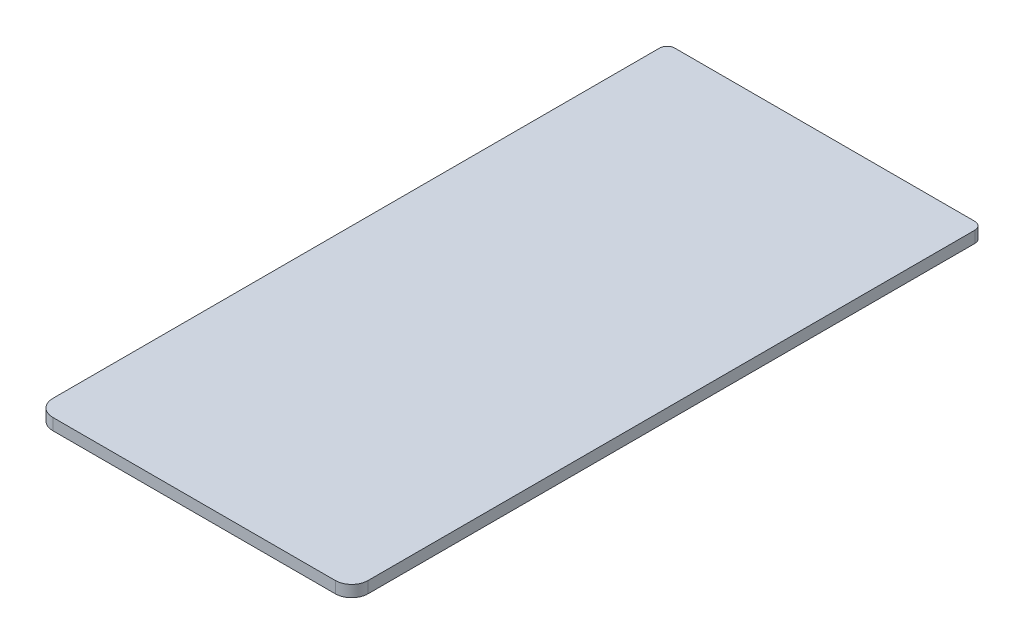
ISO-10303-21;
HEADER;
FILE_DESCRIPTION(('STEP AP214'),'2;1');
FILE_NAME('part.step','',(''),(''),'','','');
FILE_SCHEMA(('AUTOMOTIVE_DESIGN { 1 0 10303 214 1 1 1 1 }'));
ENDSEC;
DATA;
#1=APPLICATION_CONTEXT('core data for automotive mechanical design processes');
#2=APPLICATION_PROTOCOL_DEFINITION('international standard','automotive_design',2000,#1);
#3=PRODUCT_CONTEXT('',#1,'mechanical');
#4=PRODUCT('Part','Part','',(#3));
#5=PRODUCT_RELATED_PRODUCT_CATEGORY('part','',(#4));
#6=PRODUCT_DEFINITION_FORMATION('','',#4);
#7=PRODUCT_DEFINITION_CONTEXT('part definition',#1,'design');
#8=PRODUCT_DEFINITION('design','',#6,#7);
#9=PRODUCT_DEFINITION_SHAPE('','',#8);
#10=(LENGTH_UNIT() NAMED_UNIT(*) SI_UNIT(.MILLI.,.METRE.));
#11=(NAMED_UNIT(*) PLANE_ANGLE_UNIT() SI_UNIT($,.RADIAN.));
#12=(NAMED_UNIT(*) SI_UNIT($,.STERADIAN.) SOLID_ANGLE_UNIT());
#13=UNCERTAINTY_MEASURE_WITH_UNIT(LENGTH_MEASURE(1.E-05),#10,'distance_accuracy_value','');
#14=(GEOMETRIC_REPRESENTATION_CONTEXT(3) GLOBAL_UNCERTAINTY_ASSIGNED_CONTEXT((#13)) GLOBAL_UNIT_ASSIGNED_CONTEXT((#10,
#11,#12)) REPRESENTATION_CONTEXT('',''));
#15=CARTESIAN_POINT('',(0.,0.,0.));
#16=DIRECTION('',(0.,0.,1.));
#17=DIRECTION('',(1.,0.,0.));
#18=AXIS2_PLACEMENT_3D('',#15,#16,#17);
#19=CARTESIAN_POINT('',(-12.2325,1.,25.8919931721077));
#20=DIRECTION('',(0.,-1.,0.));
#21=DIRECTION('',(0.,0.,-1.));
#22=AXIS2_PLACEMENT_3D('',#19,#20,#21);
#23=CYLINDRICAL_SURFACE('',#22,1.42);
#24=CARTESIAN_POINT('',(-12.2325,0.,25.8919931721077));
#25=DIRECTION('',(0.,1.,0.));
#26=DIRECTION('',(0.,0.,1.));
#27=AXIS2_PLACEMENT_3D('',#24,#25,#26);
#28=CIRCLE('',#27,1.42);
#29=CARTESIAN_POINT('',(-13.6525,0.,25.8919931721077));
#30=VERTEX_POINT('',#29);
#31=CARTESIAN_POINT('',(-12.2325,0.,27.3119931721077));
#32=VERTEX_POINT('',#31);
#33=EDGE_CURVE('E140',#30,#32,#28,.T.);
#34=ORIENTED_EDGE('',*,*,#33,.T.);
#35=DIRECTION('',(0.,-1.,0.));
#36=VECTOR('',#35,1.);
#37=CARTESIAN_POINT('',(-12.2325,1.,27.3119931721077));
#38=LINE('',#37,#36);
#39=CARTESIAN_POINT('',(-12.2325,1.,27.3119931721077));
#40=VERTEX_POINT('',#39);
#41=EDGE_CURVE('E11',#40,#32,#38,.T.);
#42=ORIENTED_EDGE('',*,*,#41,.F.);
#43=CARTESIAN_POINT('',(-12.2325,1.,25.8919931721077));
#44=DIRECTION('',(0.,1.,0.));
#45=DIRECTION('',(0.,0.,1.));
#46=AXIS2_PLACEMENT_3D('',#43,#44,#45);
#47=CIRCLE('',#46,1.42);
#48=CARTESIAN_POINT('',(-13.6525,1.,25.8919931721077));
#49=VERTEX_POINT('',#48);
#50=EDGE_CURVE('E162',#49,#40,#47,.T.);
#51=ORIENTED_EDGE('',*,*,#50,.F.);
#52=DIRECTION('',(0.,-1.,0.));
#53=VECTOR('',#52,1.);
#54=CARTESIAN_POINT('',(-13.6525,1.,25.8919931721077));
#55=LINE('',#54,#53);
#56=EDGE_CURVE('E136',#49,#30,#55,.T.);
#57=ORIENTED_EDGE('',*,*,#56,.T.);
#58=EDGE_LOOP('',(#34,#42,#51,#57));
#59=FACE_BOUND('',#58,.T.);
#60=ADVANCED_FACE('F39',(#59),#23,.T.);
#61=CARTESIAN_POINT('',(-12.2325,1.,27.3119931721077));
#62=DIRECTION('',(0.,0.,-1.));
#63=DIRECTION('',(-1.,0.,0.));
#64=AXIS2_PLACEMENT_3D('',#61,#62,#63);
#65=PLANE('',#64);
#66=DIRECTION('',(1.,0.,0.));
#67=VECTOR('',#66,1.);
#68=CARTESIAN_POINT('',(-12.2325,0.,27.3119931721077));
#69=LINE('',#68,#67);
#70=CARTESIAN_POINT('',(12.2325,0.,27.3119931721077));
#71=VERTEX_POINT('',#70);
#72=EDGE_CURVE('E144',#32,#71,#69,.T.);
#73=ORIENTED_EDGE('',*,*,#72,.T.);
#74=DIRECTION('',(0.,-1.,0.));
#75=VECTOR('',#74,1.);
#76=CARTESIAN_POINT('',(12.2325,1.,27.3119931721077));
#77=LINE('',#76,#75);
#78=CARTESIAN_POINT('',(12.2325,1.,27.3119931721077));
#79=VERTEX_POINT('',#78);
#80=EDGE_CURVE('E48',#79,#71,#77,.T.);
#81=ORIENTED_EDGE('',*,*,#80,.F.);
#82=DIRECTION('',(1.,0.,0.));
#83=VECTOR('',#82,1.);
#84=CARTESIAN_POINT('',(-12.2325,1.,27.3119931721077));
#85=LINE('',#84,#83);
#86=EDGE_CURVE('E99',#40,#79,#85,.T.);
#87=ORIENTED_EDGE('',*,*,#86,.F.);
#88=ORIENTED_EDGE('',*,*,#41,.T.);
#89=EDGE_LOOP('',(#73,#81,#87,#88));
#90=FACE_BOUND('',#89,.T.);
#91=ADVANCED_FACE('F208',(#90),#65,.F.);
#92=CARTESIAN_POINT('',(12.2325,1.,25.8919931721077));
#93=DIRECTION('',(0.,-1.,0.));
#94=DIRECTION('',(0.,0.,-1.));
#95=AXIS2_PLACEMENT_3D('',#92,#93,#94);
#96=CYLINDRICAL_SURFACE('',#95,1.42);
#97=CARTESIAN_POINT('',(12.2325,0.,25.8919931721077));
#98=DIRECTION('',(0.,1.,0.));
#99=DIRECTION('',(0.,0.,1.));
#100=AXIS2_PLACEMENT_3D('',#97,#98,#99);
#101=CIRCLE('',#100,1.42);
#102=CARTESIAN_POINT('',(13.6525,0.,25.8919931721077));
#103=VERTEX_POINT('',#102);
#104=EDGE_CURVE('E147',#71,#103,#101,.T.);
#105=ORIENTED_EDGE('',*,*,#104,.T.);
#106=DIRECTION('',(0.,-1.,0.));
#107=VECTOR('',#106,1.);
#108=CARTESIAN_POINT('',(13.6525,1.,25.8919931721077));
#109=LINE('',#108,#107);
#110=CARTESIAN_POINT('',(13.6525,1.,25.8919931721077));
#111=VERTEX_POINT('',#110);
#112=EDGE_CURVE('E173',#111,#103,#109,.T.);
#113=ORIENTED_EDGE('',*,*,#112,.F.);
#114=CARTESIAN_POINT('',(12.2325,1.,25.8919931721077));
#115=DIRECTION('',(0.,1.,0.));
#116=DIRECTION('',(0.,0.,1.));
#117=AXIS2_PLACEMENT_3D('',#114,#115,#116);
#118=CIRCLE('',#117,1.42);
#119=EDGE_CURVE('E183',#79,#111,#118,.T.);
#120=ORIENTED_EDGE('',*,*,#119,.F.);
#121=ORIENTED_EDGE('',*,*,#80,.T.);
#122=EDGE_LOOP('',(#105,#113,#120,#121));
#123=FACE_BOUND('',#122,.T.);
#124=ADVANCED_FACE('F181',(#123),#96,.T.);
#125=CARTESIAN_POINT('',(13.6525,1.,-26.6494931721077));
#126=DIRECTION('',(-1.,0.,0.));
#127=DIRECTION('',(0.,0.,1.));
#128=AXIS2_PLACEMENT_3D('',#125,#126,#127);
#129=PLANE('',#128);
#130=DIRECTION('',(0.,0.,-1.));
#131=VECTOR('',#130,1.);
#132=CARTESIAN_POINT('',(13.6525,0.,-26.6494931721077));
#133=LINE('',#132,#131);
#134=CARTESIAN_POINT('',(13.6525,0.,-26.6494931721077));
#135=VERTEX_POINT('',#134);
#136=EDGE_CURVE('E150',#103,#135,#133,.T.);
#137=ORIENTED_EDGE('',*,*,#136,.T.);
#138=DIRECTION('',(0.,-1.,0.));
#139=VECTOR('',#138,1.);
#140=CARTESIAN_POINT('',(13.6525,1.,-26.6494931721077));
#141=LINE('',#140,#139);
#142=CARTESIAN_POINT('',(13.6525,1.,-26.6494931721077));
#143=VERTEX_POINT('',#142);
#144=EDGE_CURVE('E169',#143,#135,#141,.T.);
#145=ORIENTED_EDGE('',*,*,#144,.F.);
#146=DIRECTION('',(0.,0.,-1.));
#147=VECTOR('',#146,1.);
#148=CARTESIAN_POINT('',(13.6525,1.,-26.6494931721077));
#149=LINE('',#148,#147);
#150=EDGE_CURVE('E196',#111,#143,#149,.T.);
#151=ORIENTED_EDGE('',*,*,#150,.F.);
#152=ORIENTED_EDGE('',*,*,#112,.T.);
#153=EDGE_LOOP('',(#137,#145,#151,#152));
#154=FACE_BOUND('',#153,.T.);
#155=ADVANCED_FACE('F191',(#154),#129,.F.);
#156=CARTESIAN_POINT('',(12.99,1.,-26.6494931721077));
#157=DIRECTION('',(0.,-1.,0.));
#158=DIRECTION('',(0.,0.,-1.));
#159=AXIS2_PLACEMENT_3D('',#156,#157,#158);
#160=CYLINDRICAL_SURFACE('',#159,0.662500000000003);
#161=CARTESIAN_POINT('',(12.99,0.,-26.6494931721077));
#162=DIRECTION('',(0.,1.,0.));
#163=DIRECTION('',(0.,0.,-1.));
#164=AXIS2_PLACEMENT_3D('',#161,#162,#163);
#165=CIRCLE('',#164,0.662500000000003);
#166=CARTESIAN_POINT('',(12.99,0.,-27.3119931721077));
#167=VERTEX_POINT('',#166);
#168=EDGE_CURVE('E153',#135,#167,#165,.T.);
#169=ORIENTED_EDGE('',*,*,#168,.T.);
#170=DIRECTION('',(0.,-1.,0.));
#171=VECTOR('',#170,1.);
#172=CARTESIAN_POINT('',(12.99,1.,-27.3119931721077));
#173=LINE('',#172,#171);
#174=CARTESIAN_POINT('',(12.99,1.,-27.3119931721077));
#175=VERTEX_POINT('',#174);
#176=EDGE_CURVE('E129',#175,#167,#173,.T.);
#177=ORIENTED_EDGE('',*,*,#176,.F.);
#178=CARTESIAN_POINT('',(12.99,1.,-26.6494931721077));
#179=DIRECTION('',(0.,1.,0.));
#180=DIRECTION('',(0.,0.,-1.));
#181=AXIS2_PLACEMENT_3D('',#178,#179,#180);
#182=CIRCLE('',#181,0.662500000000003);
#183=EDGE_CURVE('E118',#143,#175,#182,.T.);
#184=ORIENTED_EDGE('',*,*,#183,.F.);
#185=ORIENTED_EDGE('',*,*,#144,.T.);
#186=EDGE_LOOP('',(#169,#177,#184,#185));
#187=FACE_BOUND('',#186,.T.);
#188=ADVANCED_FACE('F194',(#187),#160,.T.);
#189=CARTESIAN_POINT('',(-12.99,1.,-27.3119931721077));
#190=DIRECTION('',(0.,0.,1.));
#191=DIRECTION('',(1.,0.,0.));
#192=AXIS2_PLACEMENT_3D('',#189,#190,#191);
#193=PLANE('',#192);
#194=DIRECTION('',(-1.,0.,0.));
#195=VECTOR('',#194,1.);
#196=CARTESIAN_POINT('',(-12.99,0.,-27.3119931721077));
#197=LINE('',#196,#195);
#198=CARTESIAN_POINT('',(-12.99,0.,-27.3119931721077));
#199=VERTEX_POINT('',#198);
#200=EDGE_CURVE('E127',#167,#199,#197,.T.);
#201=ORIENTED_EDGE('',*,*,#200,.T.);
#202=DIRECTION('',(0.,-1.,0.));
#203=VECTOR('',#202,1.);
#204=CARTESIAN_POINT('',(-12.99,1.,-27.3119931721077));
#205=LINE('',#204,#203);
#206=CARTESIAN_POINT('',(-12.99,1.,-27.3119931721077));
#207=VERTEX_POINT('',#206);
#208=EDGE_CURVE('E124',#207,#199,#205,.T.);
#209=ORIENTED_EDGE('',*,*,#208,.F.);
#210=DIRECTION('',(-1.,0.,0.));
#211=VECTOR('',#210,1.);
#212=CARTESIAN_POINT('',(-12.99,1.,-27.3119931721077));
#213=LINE('',#212,#211);
#214=EDGE_CURVE('E112',#175,#207,#213,.T.);
#215=ORIENTED_EDGE('',*,*,#214,.F.);
#216=ORIENTED_EDGE('',*,*,#176,.T.);
#217=EDGE_LOOP('',(#201,#209,#215,#216));
#218=FACE_BOUND('',#217,.T.);
#219=ADVANCED_FACE('F125',(#218),#193,.F.);
#220=CARTESIAN_POINT('',(-12.99,1.,-26.6494931721077));
#221=DIRECTION('',(0.,-1.,0.));
#222=DIRECTION('',(0.,0.,-1.));
#223=AXIS2_PLACEMENT_3D('',#220,#221,#222);
#224=CYLINDRICAL_SURFACE('',#223,0.662499999999996);
#225=CARTESIAN_POINT('',(-12.99,0.,-26.6494931721077));
#226=DIRECTION('',(0.,1.,0.));
#227=DIRECTION('',(0.,0.,1.));
#228=AXIS2_PLACEMENT_3D('',#225,#226,#227);
#229=CIRCLE('',#228,0.662499999999996);
#230=CARTESIAN_POINT('',(-13.6525,0.,-26.6494931721077));
#231=VERTEX_POINT('',#230);
#232=EDGE_CURVE('E85',#199,#231,#229,.T.);
#233=ORIENTED_EDGE('',*,*,#232,.T.);
#234=DIRECTION('',(0.,-1.,0.));
#235=VECTOR('',#234,1.);
#236=CARTESIAN_POINT('',(-13.6525,1.,-26.6494931721077));
#237=LINE('',#236,#235);
#238=CARTESIAN_POINT('',(-13.6525,1.,-26.6494931721077));
#239=VERTEX_POINT('',#238);
#240=EDGE_CURVE('E130',#239,#231,#237,.T.);
#241=ORIENTED_EDGE('',*,*,#240,.F.);
#242=CARTESIAN_POINT('',(-12.99,1.,-26.6494931721077));
#243=DIRECTION('',(0.,1.,0.));
#244=DIRECTION('',(0.,0.,1.));
#245=AXIS2_PLACEMENT_3D('',#242,#243,#244);
#246=CIRCLE('',#245,0.662499999999996);
#247=EDGE_CURVE('E116',#207,#239,#246,.T.);
#248=ORIENTED_EDGE('',*,*,#247,.F.);
#249=ORIENTED_EDGE('',*,*,#208,.T.);
#250=EDGE_LOOP('',(#233,#241,#248,#249));
#251=FACE_BOUND('',#250,.T.);
#252=ADVANCED_FACE('F132',(#251),#224,.T.);
#253=CARTESIAN_POINT('',(-13.6525,1.,-26.6494931721077));
#254=DIRECTION('',(1.,0.,0.));
#255=DIRECTION('',(0.,0.,-1.));
#256=AXIS2_PLACEMENT_3D('',#253,#254,#255);
#257=PLANE('',#256);
#258=DIRECTION('',(0.,0.,1.));
#259=VECTOR('',#258,1.);
#260=CARTESIAN_POINT('',(-13.6525,0.,-26.6494931721077));
#261=LINE('',#260,#259);
#262=EDGE_CURVE('E91',#231,#30,#261,.T.);
#263=ORIENTED_EDGE('',*,*,#262,.T.);
#264=ORIENTED_EDGE('',*,*,#56,.F.);
#265=DIRECTION('',(0.,0.,1.));
#266=VECTOR('',#265,1.);
#267=CARTESIAN_POINT('',(-13.6525,1.,-26.6494931721077));
#268=LINE('',#267,#266);
#269=EDGE_CURVE('E56',#239,#49,#268,.T.);
#270=ORIENTED_EDGE('',*,*,#269,.F.);
#271=ORIENTED_EDGE('',*,*,#240,.T.);
#272=EDGE_LOOP('',(#263,#264,#270,#271));
#273=FACE_BOUND('',#272,.T.);
#274=ADVANCED_FACE('F224',(#273),#257,.F.);
#275=CARTESIAN_POINT('',(-12.2325,1.,25.8919931721077));
#276=DIRECTION('',(0.,1.,0.));
#277=DIRECTION('',(0.,0.,1.));
#278=AXIS2_PLACEMENT_3D('',#275,#276,#277);
#279=PLANE('',#278);
#280=ORIENTED_EDGE('',*,*,#50,.T.);
#281=ORIENTED_EDGE('',*,*,#86,.T.);
#282=ORIENTED_EDGE('',*,*,#119,.T.);
#283=ORIENTED_EDGE('',*,*,#150,.T.);
#284=ORIENTED_EDGE('',*,*,#183,.T.);
#285=ORIENTED_EDGE('',*,*,#214,.T.);
#286=ORIENTED_EDGE('',*,*,#247,.T.);
#287=ORIENTED_EDGE('',*,*,#269,.T.);
#288=EDGE_LOOP('',(#280,#281,#282,#283,#284,#285,#286,#287));
#289=FACE_BOUND('',#288,.T.);
#290=ADVANCED_FACE('F114',(#289),#279,.T.);
#291=CARTESIAN_POINT('',(-12.2325,0.,25.8919931721077));
#292=DIRECTION('',(0.,1.,0.));
#293=DIRECTION('',(0.,0.,1.));
#294=AXIS2_PLACEMENT_3D('',#291,#292,#293);
#295=PLANE('',#294);
#296=ORIENTED_EDGE('',*,*,#33,.F.);
#297=ORIENTED_EDGE('',*,*,#262,.F.);
#298=ORIENTED_EDGE('',*,*,#232,.F.);
#299=ORIENTED_EDGE('',*,*,#200,.F.);
#300=ORIENTED_EDGE('',*,*,#168,.F.);
#301=ORIENTED_EDGE('',*,*,#136,.F.);
#302=ORIENTED_EDGE('',*,*,#104,.F.);
#303=ORIENTED_EDGE('',*,*,#72,.F.);
#304=EDGE_LOOP('',(#296,#297,#298,#299,#300,#301,#302,#303));
#305=FACE_BOUND('',#304,.T.);
#306=ADVANCED_FACE('F187',(#305),#295,.F.);
#307=CLOSED_SHELL('',(#60,#91,#124,#155,#188,#219,#252,#274,#290,#306));
#308=MANIFOLD_SOLID_BREP('B2',#307);
#309=ADVANCED_BREP_SHAPE_REPRESENTATION('',(#18,#308),#14);
#310=SHAPE_DEFINITION_REPRESENTATION(#9,#309);
ENDSEC;
END-ISO-10303-21;
